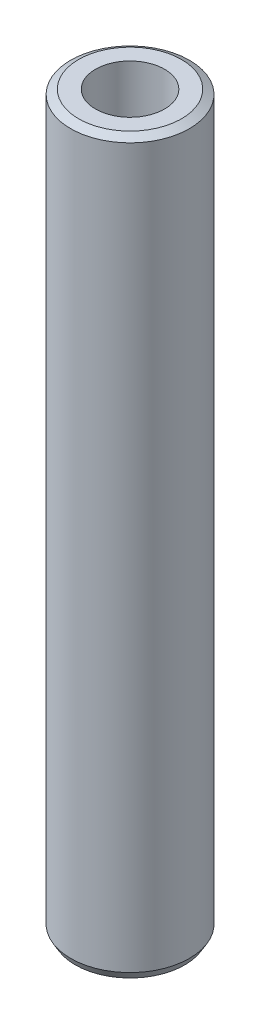
ISO-10303-21;
HEADER;
FILE_DESCRIPTION(('STEP AP214'),'2;1');
FILE_NAME('part.step','',(''),(''),'','','');
FILE_SCHEMA(('AUTOMOTIVE_DESIGN { 1 0 10303 214 1 1 1 1 }'));
ENDSEC;
DATA;
#1=APPLICATION_CONTEXT('core data for automotive mechanical design processes');
#2=APPLICATION_PROTOCOL_DEFINITION('international standard','automotive_design',2000,#1);
#3=PRODUCT_CONTEXT('',#1,'mechanical');
#4=PRODUCT('Part','Part','',(#3));
#5=PRODUCT_RELATED_PRODUCT_CATEGORY('part','',(#4));
#6=PRODUCT_DEFINITION_FORMATION('','',#4);
#7=PRODUCT_DEFINITION_CONTEXT('part definition',#1,'design');
#8=PRODUCT_DEFINITION('design','',#6,#7);
#9=PRODUCT_DEFINITION_SHAPE('','',#8);
#10=(LENGTH_UNIT() NAMED_UNIT(*) SI_UNIT(.MILLI.,.METRE.));
#11=(NAMED_UNIT(*) PLANE_ANGLE_UNIT() SI_UNIT($,.RADIAN.));
#12=(NAMED_UNIT(*) SI_UNIT($,.STERADIAN.) SOLID_ANGLE_UNIT());
#13=UNCERTAINTY_MEASURE_WITH_UNIT(LENGTH_MEASURE(1.E-05),#10,'distance_accuracy_value','');
#14=(GEOMETRIC_REPRESENTATION_CONTEXT(3) GLOBAL_UNCERTAINTY_ASSIGNED_CONTEXT((#13)) GLOBAL_UNIT_ASSIGNED_CONTEXT((#10,
#11,#12)) REPRESENTATION_CONTEXT('',''));
#15=CARTESIAN_POINT('',(0.,0.,0.));
#16=DIRECTION('',(0.,0.,1.));
#17=DIRECTION('',(1.,0.,0.));
#18=AXIS2_PLACEMENT_3D('',#15,#16,#17);
#19=CARTESIAN_POINT('',(0.,92.3610053605835,0.));
#20=DIRECTION('',(0.,-1.,0.));
#21=DIRECTION('',(0.,0.,-1.));
#22=AXIS2_PLACEMENT_3D('',#19,#20,#21);
#23=CYLINDRICAL_SURFACE('',#22,7.5);
#24=CARTESIAN_POINT('',(0.,91.7822154952858,0.));
#25=DIRECTION('',(0.,1.,0.));
#26=DIRECTION('',(0.,0.,1.));
#27=AXIS2_PLACEMENT_3D('',#24,#25,#26);
#28=CIRCLE('',#27,7.5);
#29=CARTESIAN_POINT('',(0.,91.7822154952858,-7.50000000000001));
#30=VERTEX_POINT('',#29);
#31=EDGE_CURVE('E50',#30,#30,#28,.F.);
#32=ORIENTED_EDGE('',*,*,#31,.T.);
#33=EDGE_LOOP('',(#32));
#34=FACE_BOUND('',#33,.T.);
#35=CARTESIAN_POINT('',(0.,1.0024934536015,0.));
#36=DIRECTION('',(0.,1.,0.));
#37=DIRECTION('',(0.,0.,1.));
#38=AXIS2_PLACEMENT_3D('',#35,#36,#37);
#39=CIRCLE('',#38,7.5);
#40=CARTESIAN_POINT('',(0.,1.0024934536015,7.5));
#41=VERTEX_POINT('',#40);
#42=EDGE_CURVE('E51',#41,#41,#39,.T.);
#43=ORIENTED_EDGE('',*,*,#42,.T.);
#44=EDGE_LOOP('',(#43));
#45=FACE_BOUND('',#44,.T.);
#46=ADVANCED_FACE('F39',(#34,#45),#23,.T.);
#47=CARTESIAN_POINT('',(0.,92.3610053605835,0.));
#48=DIRECTION('',(0.,1.,0.));
#49=DIRECTION('',(0.,0.,1.));
#50=AXIS2_PLACEMENT_3D('',#47,#48,#49);
#51=PLANE('',#50);
#52=CARTESIAN_POINT('',(0.,92.3610053605835,0.));
#53=DIRECTION('',(0.,1.,0.));
#54=DIRECTION('',(0.,0.,1.));
#55=AXIS2_PLACEMENT_3D('',#52,#53,#54);
#56=CIRCLE('',#55,6.49750654639854);
#57=CARTESIAN_POINT('',(0.,92.3610053605835,-6.49750654639855));
#58=VERTEX_POINT('',#57);
#59=EDGE_CURVE('E54',#58,#58,#56,.T.);
#60=ORIENTED_EDGE('',*,*,#59,.T.);
#61=EDGE_LOOP('',(#60));
#62=FACE_BOUND('',#61,.T.);
#63=CARTESIAN_POINT('',(0.,92.3610053605835,0.));
#64=DIRECTION('',(0.,1.,0.));
#65=DIRECTION('',(0.,0.,1.));
#66=AXIS2_PLACEMENT_3D('',#63,#64,#65);
#67=CIRCLE('',#66,4.36139152646692);
#68=CARTESIAN_POINT('',(0.,92.3610053605835,4.36139152646692));
#69=VERTEX_POINT('',#68);
#70=EDGE_CURVE('E58',#69,#69,#67,.T.);
#71=ORIENTED_EDGE('',*,*,#70,.F.);
#72=EDGE_LOOP('',(#71));
#73=FACE_BOUND('',#72,.T.);
#74=ADVANCED_FACE('F69',(#62,#73),#51,.T.);
#75=CARTESIAN_POINT('',(0.,0.,0.));
#76=DIRECTION('',(0.,1.,0.));
#77=DIRECTION('',(0.,0.,1.));
#78=AXIS2_PLACEMENT_3D('',#75,#76,#77);
#79=PLANE('',#78);
#80=CARTESIAN_POINT('',(0.,0.,0.));
#81=DIRECTION('',(0.,1.,0.));
#82=DIRECTION('',(0.,0.,1.));
#83=AXIS2_PLACEMENT_3D('',#80,#81,#82);
#84=CIRCLE('',#83,6.92121013470234);
#85=CARTESIAN_POINT('',(0.,0.,6.92121013470234));
#86=VERTEX_POINT('',#85);
#87=EDGE_CURVE('E10',#86,#86,#84,.F.);
#88=ORIENTED_EDGE('',*,*,#87,.T.);
#89=EDGE_LOOP('',(#88));
#90=FACE_BOUND('',#89,.T.);
#91=CARTESIAN_POINT('',(0.,0.,0.));
#92=DIRECTION('',(0.,1.,0.));
#93=DIRECTION('',(0.,0.,1.));
#94=AXIS2_PLACEMENT_3D('',#91,#92,#93);
#95=CIRCLE('',#94,4.36139152646692);
#96=CARTESIAN_POINT('',(0.,0.,4.36139152646692));
#97=VERTEX_POINT('',#96);
#98=EDGE_CURVE('E63',#97,#97,#95,.T.);
#99=ORIENTED_EDGE('',*,*,#98,.T.);
#100=EDGE_LOOP('',(#99));
#101=FACE_BOUND('',#100,.T.);
#102=ADVANCED_FACE('F75',(#90,#101),#79,.F.);
#103=CARTESIAN_POINT('',(0.,92.3610053605835,0.));
#104=DIRECTION('',(0.,-1.,0.));
#105=DIRECTION('',(0.,0.,-1.));
#106=AXIS2_PLACEMENT_3D('',#103,#104,#105);
#107=CYLINDRICAL_SURFACE('',#106,4.36139152646692);
#108=ORIENTED_EDGE('',*,*,#70,.T.);
#109=EDGE_LOOP('',(#108));
#110=FACE_BOUND('',#109,.T.);
#111=ORIENTED_EDGE('',*,*,#98,.F.);
#112=EDGE_LOOP('',(#111));
#113=FACE_BOUND('',#112,.T.);
#114=ADVANCED_FACE('F70',(#110,#113),#107,.F.);
#115=CARTESIAN_POINT('',(0.,92.3610053605835,0.));
#116=DIRECTION('',(0.,-1.,0.));
#117=DIRECTION('',(0.,0.,-1.));
#118=AXIS2_PLACEMENT_3D('',#115,#116,#117);
#119=CONICAL_SURFACE('',#118,6.49750654639854,1.04719755119659);
#120=CARTESIAN_POINT('',(0.,91.7822154952858,-7.50000000000001));
#121=CARTESIAN_POINT('',(0.,91.7882445563827,-7.48955735985833));
#122=CARTESIAN_POINT('',(0.,91.7942736174795,-7.47911471971665));
#123=CARTESIAN_POINT('',(0.,91.8063317396732,-7.45822943943328));
#124=CARTESIAN_POINT('',(0.,91.8123608007701,-7.4477867992916));
#125=CARTESIAN_POINT('',(0.,91.8244189229638,-7.42690151900824));
#126=CARTESIAN_POINT('',(0.,91.8304479840606,-7.41645887886656));
#127=CARTESIAN_POINT('',(0.,91.8425061062543,-7.39557359858319));
#128=CARTESIAN_POINT('',(0.,91.8485351673512,-7.38513095844151));
#129=CARTESIAN_POINT('',(0.,91.8605932895449,-7.36424567815815));
#130=CARTESIAN_POINT('',(0.,91.8666223506417,-7.35380303801647));
#131=CARTESIAN_POINT('',(0.,91.8786804728354,-7.3329177577331));
#132=CARTESIAN_POINT('',(0.,91.8847095339323,-7.32247511759142));
#133=CARTESIAN_POINT('',(0.,91.896767656126,-7.30158983730805));
#134=CARTESIAN_POINT('',(0.,91.9027967172228,-7.29114719716637));
#135=CARTESIAN_POINT('',(0.,91.9148548394165,-7.27026191688301));
#136=CARTESIAN_POINT('',(0.,91.9208839005134,-7.25981927674133));
#137=CARTESIAN_POINT('',(0.,91.9329420227071,-7.23893399645796));
#138=CARTESIAN_POINT('',(0.,91.9389710838039,-7.22849135631628));
#139=CARTESIAN_POINT('',(0.,91.9510292059976,-7.20760607603292));
#140=CARTESIAN_POINT('',(0.,91.9570582670945,-7.19716343589124));
#141=CARTESIAN_POINT('',(0.,91.9691163892882,-7.17627815560787));
#142=CARTESIAN_POINT('',(0.,91.975145450385,-7.16583551546619));
#143=CARTESIAN_POINT('',(0.,91.9872035725787,-7.14495023518283));
#144=CARTESIAN_POINT('',(0.,91.9932326336756,-7.13450759504114));
#145=CARTESIAN_POINT('',(0.,92.0052907558693,-7.11362231475778));
#146=CARTESIAN_POINT('',(0.,92.0113198169661,-7.1031796746161));
#147=CARTESIAN_POINT('',(0.,92.0233779391599,-7.08229439433274));
#148=CARTESIAN_POINT('',(0.,92.0294070002567,-7.07185175419105));
#149=CARTESIAN_POINT('',(0.,92.0414651224504,-7.05096647390769));
#150=CARTESIAN_POINT('',(0.,92.0474941835472,-7.04052383376601));
#151=CARTESIAN_POINT('',(0.,92.059552305741,-7.01963855348264));
#152=CARTESIAN_POINT('',(0.,92.0655813668378,-7.00919591334096));
#153=CARTESIAN_POINT('',(0.,92.0776394890315,-6.9883106330576));
#154=CARTESIAN_POINT('',(0.,92.0836685501283,-6.97786799291592));
#155=CARTESIAN_POINT('',(0.,92.095726672322,-6.95698271263255));
#156=CARTESIAN_POINT('',(0.,92.1017557334189,-6.94654007249087));
#157=CARTESIAN_POINT('',(0.,92.1138138556126,-6.92565479220751));
#158=CARTESIAN_POINT('',(0.,92.1198429167094,-6.91521215206582));
#159=CARTESIAN_POINT('',(0.,92.1319010389032,-6.89432687178246));
#160=CARTESIAN_POINT('',(0.,92.1379301,-6.88388423164078));
#161=CARTESIAN_POINT('',(0.,92.1499882221937,-6.86299895135742));
#162=CARTESIAN_POINT('',(0.,92.1560172832906,-6.85255631121573));
#163=CARTESIAN_POINT('',(0.,92.1680754054843,-6.83167103093237));
#164=CARTESIAN_POINT('',(0.,92.1741044665811,-6.82122839079069));
#165=CARTESIAN_POINT('',(0.,92.1861625887748,-6.80034311050732));
#166=CARTESIAN_POINT('',(0.,92.1921916498716,-6.78990047036564));
#167=CARTESIAN_POINT('',(0.,92.2042497720654,-6.76901519008228));
#168=CARTESIAN_POINT('',(0.,92.2102788331622,-6.7585725499406));
#169=CARTESIAN_POINT('',(0.,92.2223369553559,-6.73768726965723));
#170=CARTESIAN_POINT('',(0.,92.2283660164528,-6.72724462951555));
#171=CARTESIAN_POINT('',(0.,92.2404241386465,-6.70635934923219));
#172=CARTESIAN_POINT('',(0.,92.2464531997433,-6.69591670909051));
#173=CARTESIAN_POINT('',(0.,92.258511321937,-6.67503142880714));
#174=CARTESIAN_POINT('',(0.,92.2645403830339,-6.66458878866546));
#175=CARTESIAN_POINT('',(0.,92.2765985052276,-6.6437035083821));
#176=CARTESIAN_POINT('',(0.,92.2826275663244,-6.63326086824041));
#177=CARTESIAN_POINT('',(0.,92.2946856885181,-6.61237558795705));
#178=CARTESIAN_POINT('',(0.,92.300714749615,-6.60193294781537));
#179=CARTESIAN_POINT('',(0.,92.3127728718087,-6.581047667532));
#180=CARTESIAN_POINT('',(0.,92.3188019329055,-6.57060502739032));
#181=CARTESIAN_POINT('',(0.,92.3308600550992,-6.54971974710696));
#182=CARTESIAN_POINT('',(0.,92.3368891161961,-6.53927710696528));
#183=CARTESIAN_POINT('',(0.,92.3489472383898,-6.51839182668191));
#184=CARTESIAN_POINT('',(0.,92.3549762994866,-6.50794918654023));
#185=CARTESIAN_POINT('',(0.,92.3610053605835,-6.49750654639855));
#186=B_SPLINE_CURVE_WITH_KNOTS('',3,(#120,#121,#122,#123,#124,#125,#126,#127,#128,#129,#130,
#131,#132,#133,#134,#135,#136,#137,#138,#139,#140,#141,#142,#143,#144,#145,#146,#147,#148,#149,
#150,#151,#152,#153,#154,#155,#156,#157,#158,#159,#160,#161,#162,#163,#164,#165,#166,#167,#168,
#169,#170,#171,#172,#173,#174,#175,#176,#177,#178,#179,#180,#181,#182,#183,#184,#185),
.UNSPECIFIED.,.F.,.F.,(4,2,2,2,2,2,2,2,2,2,2,2,2,2,2,2,2,2,2,2,2,2,2,2,2,2,2,2,2,2,2,2,4),(0.,
0.0361743665811015,0.0723487331622037,0.108523099743305,0.144697466324407,0.180871832905508,
0.21704619948661,0.253220566067719,0.28939493264882,0.325569299229922,0.361743665811024,
0.397918032392125,0.434092398973227,0.470266765554335,0.506441132135437,0.542615498716539,
0.57878986529764,0.614964231878741,0.651138598459844,0.687312965040945,0.723487331622054,
0.759661698203155,0.795836064784257,0.832010431365359,0.86818479794646,0.904359164527562,
0.940533531108671,0.976707897689772,1.01288226427087,1.04905663085198,1.08523099743308,
1.12140536401418,1.15757973059529),.UNSPECIFIED.);
#187=EDGE_CURVE('BSEAM81',#30,#58,#186,.T.);
#188=ORIENTED_EDGE('',*,*,#31,.F.);
#189=ORIENTED_EDGE('',*,*,#59,.F.);
#190=ORIENTED_EDGE('',*,*,#187,.T.);
#191=ORIENTED_EDGE('',*,*,#187,.F.);
#192=EDGE_LOOP('',(#188,#190,#189,#191));
#193=FACE_BOUND('',#192,.T.);
#194=ADVANCED_FACE('F81',(#193),#119,.T.);
#195=CARTESIAN_POINT('',(0.,1.0024934536015,0.));
#196=DIRECTION('',(0.,1.,0.));
#197=DIRECTION('',(0.,0.,1.));
#198=AXIS2_PLACEMENT_3D('',#195,#196,#197);
#199=CONICAL_SURFACE('',#198,7.5,0.5235987755983);
#200=ORIENTED_EDGE('',*,*,#87,.F.);
#201=EDGE_LOOP('',(#200));
#202=FACE_BOUND('',#201,.T.);
#203=ORIENTED_EDGE('',*,*,#42,.F.);
#204=EDGE_LOOP('',(#203));
#205=FACE_BOUND('',#204,.T.);
#206=ADVANCED_FACE('F45',(#202,#205),#199,.T.);
#207=CLOSED_SHELL('',(#46,#74,#102,#114,#194,#206));
#208=MANIFOLD_SOLID_BREP('B2',#207);
#209=ADVANCED_BREP_SHAPE_REPRESENTATION('',(#18,#208),#14);
#210=SHAPE_DEFINITION_REPRESENTATION(#9,#209);
ENDSEC;
END-ISO-10303-21;
